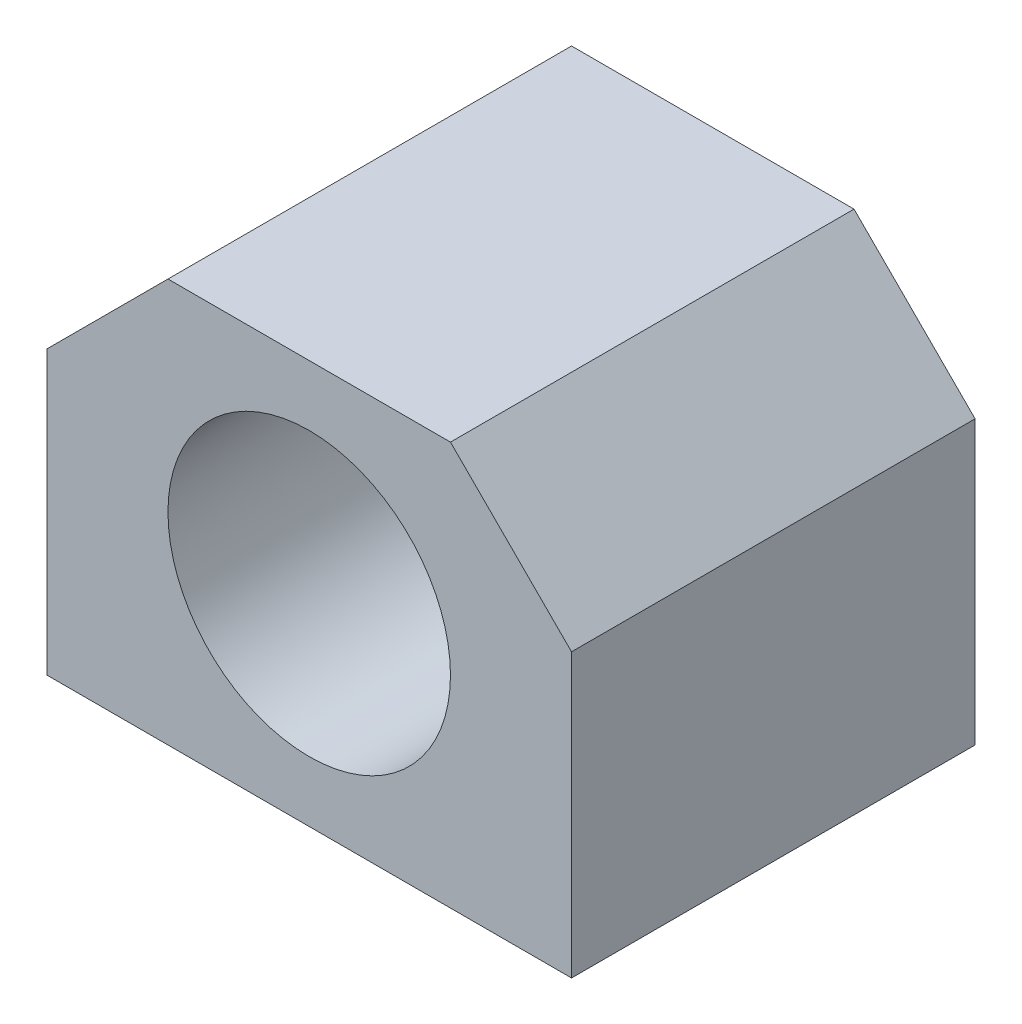
ISO-10303-21;
HEADER;
FILE_DESCRIPTION(('STEP AP214'),'2;1');
FILE_NAME('part.step','',(''),(''),'','','');
FILE_SCHEMA(('AUTOMOTIVE_DESIGN { 1 0 10303 214 1 1 1 1 }'));
ENDSEC;
DATA;
#1=APPLICATION_CONTEXT('core data for automotive mechanical design processes');
#2=APPLICATION_PROTOCOL_DEFINITION('international standard','automotive_design',2000,#1);
#3=PRODUCT_CONTEXT('',#1,'mechanical');
#4=PRODUCT('Part','Part','',(#3));
#5=PRODUCT_RELATED_PRODUCT_CATEGORY('part','',(#4));
#6=PRODUCT_DEFINITION_FORMATION('','',#4);
#7=PRODUCT_DEFINITION_CONTEXT('part definition',#1,'design');
#8=PRODUCT_DEFINITION('design','',#6,#7);
#9=PRODUCT_DEFINITION_SHAPE('','',#8);
#10=(LENGTH_UNIT() NAMED_UNIT(*) SI_UNIT(.MILLI.,.METRE.));
#11=(NAMED_UNIT(*) PLANE_ANGLE_UNIT() SI_UNIT($,.RADIAN.));
#12=(NAMED_UNIT(*) SI_UNIT($,.STERADIAN.) SOLID_ANGLE_UNIT());
#13=UNCERTAINTY_MEASURE_WITH_UNIT(LENGTH_MEASURE(1.E-05),#10,'distance_accuracy_value','');
#14=(GEOMETRIC_REPRESENTATION_CONTEXT(3) GLOBAL_UNCERTAINTY_ASSIGNED_CONTEXT((#13)) GLOBAL_UNIT_ASSIGNED_CONTEXT((#10,
#11,#12)) REPRESENTATION_CONTEXT('',''));
#15=CARTESIAN_POINT('',(0.,0.,0.));
#16=DIRECTION('',(0.,0.,1.));
#17=DIRECTION('',(1.,0.,0.));
#18=AXIS2_PLACEMENT_3D('',#15,#16,#17);
#19=CARTESIAN_POINT('',(0.,0.,40.));
#20=DIRECTION('',(0.,0.,1.));
#21=DIRECTION('',(1.,0.,0.));
#22=AXIS2_PLACEMENT_3D('',#19,#20,#21);
#23=PLANE('',#22);
#24=DIRECTION('',(1.,0.,0.));
#25=VECTOR('',#24,1.);
#26=CARTESIAN_POINT('',(-26.,-20.,40.));
#27=LINE('',#26,#25);
#28=CARTESIAN_POINT('',(-26.,-20.,40.));
#29=VERTEX_POINT('',#28);
#30=CARTESIAN_POINT('',(26.,-20.,40.));
#31=VERTEX_POINT('',#30);
#32=EDGE_CURVE('E149',#29,#31,#27,.T.);
#33=ORIENTED_EDGE('',*,*,#32,.T.);
#34=DIRECTION('',(0.,1.,0.));
#35=VECTOR('',#34,1.);
#36=CARTESIAN_POINT('',(26.,-20.,40.));
#37=LINE('',#36,#35);
#38=CARTESIAN_POINT('',(26.,7.99999999999997,40.));
#39=VERTEX_POINT('',#38);
#40=EDGE_CURVE('E97',#31,#39,#37,.T.);
#41=ORIENTED_EDGE('',*,*,#40,.T.);
#42=DIRECTION('',(-0.707106781186546,0.707106781186549,0.));
#43=VECTOR('',#42,1.);
#44=CARTESIAN_POINT('',(26.,7.99999999999997,40.));
#45=LINE('',#44,#43);
#46=CARTESIAN_POINT('',(14.,20.,40.));
#47=VERTEX_POINT('',#46);
#48=EDGE_CURVE('E110',#39,#47,#45,.T.);
#49=ORIENTED_EDGE('',*,*,#48,.T.);
#50=DIRECTION('',(-1.,0.,0.));
#51=VECTOR('',#50,1.);
#52=CARTESIAN_POINT('',(-14.,20.,40.));
#53=LINE('',#52,#51);
#54=CARTESIAN_POINT('',(-14.,20.,40.));
#55=VERTEX_POINT('',#54);
#56=EDGE_CURVE('E104',#47,#55,#53,.T.);
#57=ORIENTED_EDGE('',*,*,#56,.T.);
#58=DIRECTION('',(-0.707106781186546,-0.707106781186549,0.));
#59=VECTOR('',#58,1.);
#60=CARTESIAN_POINT('',(-26.,7.99999999999995,40.));
#61=LINE('',#60,#59);
#62=CARTESIAN_POINT('',(-26.,7.99999999999995,40.));
#63=VERTEX_POINT('',#62);
#64=EDGE_CURVE('E108',#55,#63,#61,.T.);
#65=ORIENTED_EDGE('',*,*,#64,.T.);
#66=DIRECTION('',(0.,-1.,0.));
#67=VECTOR('',#66,1.);
#68=CARTESIAN_POINT('',(-26.,-20.,40.));
#69=LINE('',#68,#67);
#70=EDGE_CURVE('E60',#63,#29,#69,.T.);
#71=ORIENTED_EDGE('',*,*,#70,.T.);
#72=EDGE_LOOP('',(#33,#41,#49,#57,#65,#71));
#73=FACE_BOUND('',#72,.T.);
#74=CARTESIAN_POINT('',(0.,0.,40.));
#75=DIRECTION('',(0.,0.,1.));
#76=DIRECTION('',(1.,0.,0.));
#77=AXIS2_PLACEMENT_3D('',#74,#75,#76);
#78=CIRCLE('',#77,14.);
#79=CARTESIAN_POINT('',(14.,0.,40.));
#80=VERTEX_POINT('',#79);
#81=EDGE_CURVE('E137',#80,#80,#78,.T.);
#82=ORIENTED_EDGE('',*,*,#81,.F.);
#83=EDGE_LOOP('',(#82));
#84=FACE_BOUND('',#83,.T.);
#85=ADVANCED_FACE('F42',(#73,#84),#23,.T.);
#86=CARTESIAN_POINT('',(0.,0.,0.));
#87=DIRECTION('',(0.,0.,1.));
#88=DIRECTION('',(1.,0.,0.));
#89=AXIS2_PLACEMENT_3D('',#86,#87,#88);
#90=PLANE('',#89);
#91=DIRECTION('',(1.,0.,0.));
#92=VECTOR('',#91,1.);
#93=CARTESIAN_POINT('',(-26.,-20.,0.));
#94=LINE('',#93,#92);
#95=CARTESIAN_POINT('',(-26.,-20.,0.));
#96=VERTEX_POINT('',#95);
#97=CARTESIAN_POINT('',(26.,-20.,0.));
#98=VERTEX_POINT('',#97);
#99=EDGE_CURVE('E132',#96,#98,#94,.T.);
#100=ORIENTED_EDGE('',*,*,#99,.F.);
#101=DIRECTION('',(0.,-1.,0.));
#102=VECTOR('',#101,1.);
#103=CARTESIAN_POINT('',(-26.,-20.,0.));
#104=LINE('',#103,#102);
#105=CARTESIAN_POINT('',(-26.,7.99999999999995,0.));
#106=VERTEX_POINT('',#105);
#107=EDGE_CURVE('E89',#106,#96,#104,.T.);
#108=ORIENTED_EDGE('',*,*,#107,.F.);
#109=DIRECTION('',(-0.707106781186546,-0.707106781186549,0.));
#110=VECTOR('',#109,1.);
#111=CARTESIAN_POINT('',(-26.,7.99999999999995,0.));
#112=LINE('',#111,#110);
#113=CARTESIAN_POINT('',(-14.,20.,0.));
#114=VERTEX_POINT('',#113);
#115=EDGE_CURVE('E83',#114,#106,#112,.T.);
#116=ORIENTED_EDGE('',*,*,#115,.F.);
#117=DIRECTION('',(-1.,0.,0.));
#118=VECTOR('',#117,1.);
#119=CARTESIAN_POINT('',(-14.,20.,0.));
#120=LINE('',#119,#118);
#121=CARTESIAN_POINT('',(14.,20.,0.));
#122=VERTEX_POINT('',#121);
#123=EDGE_CURVE('E119',#122,#114,#120,.T.);
#124=ORIENTED_EDGE('',*,*,#123,.F.);
#125=DIRECTION('',(-0.707106781186546,0.707106781186549,0.));
#126=VECTOR('',#125,1.);
#127=CARTESIAN_POINT('',(26.,7.99999999999997,0.));
#128=LINE('',#127,#126);
#129=CARTESIAN_POINT('',(26.,7.99999999999997,0.));
#130=VERTEX_POINT('',#129);
#131=EDGE_CURVE('E140',#130,#122,#128,.T.);
#132=ORIENTED_EDGE('',*,*,#131,.F.);
#133=DIRECTION('',(0.,1.,0.));
#134=VECTOR('',#133,1.);
#135=CARTESIAN_POINT('',(26.,-20.,0.));
#136=LINE('',#135,#134);
#137=EDGE_CURVE('E136',#98,#130,#136,.T.);
#138=ORIENTED_EDGE('',*,*,#137,.F.);
#139=EDGE_LOOP('',(#100,#108,#116,#124,#132,#138));
#140=FACE_BOUND('',#139,.T.);
#141=CARTESIAN_POINT('',(0.,0.,0.));
#142=DIRECTION('',(0.,0.,1.));
#143=DIRECTION('',(1.,0.,0.));
#144=AXIS2_PLACEMENT_3D('',#141,#142,#143);
#145=CIRCLE('',#144,14.);
#146=CARTESIAN_POINT('',(14.,0.,0.));
#147=VERTEX_POINT('',#146);
#148=EDGE_CURVE('E251',#147,#147,#145,.T.);
#149=ORIENTED_EDGE('',*,*,#148,.T.);
#150=EDGE_LOOP('',(#149));
#151=FACE_BOUND('',#150,.T.);
#152=ADVANCED_FACE('F162',(#140,#151),#90,.F.);
#153=CARTESIAN_POINT('',(-26.,-20.,40.));
#154=DIRECTION('',(0.,1.,0.));
#155=DIRECTION('',(-1.,0.,0.));
#156=AXIS2_PLACEMENT_3D('',#153,#154,#155);
#157=PLANE('',#156);
#158=CARTESIAN_POINT('',(-20.,-20.,8.));
#159=DIRECTION('',(0.,-1.,0.));
#160=DIRECTION('',(1.,0.,0.));
#161=AXIS2_PLACEMENT_3D('',#158,#159,#160);
#162=CIRCLE('',#161,2.1);
#163=CARTESIAN_POINT('',(-17.9,-20.,8.));
#164=VERTEX_POINT('',#163);
#165=EDGE_CURVE('E245',#164,#164,#162,.T.);
#166=ORIENTED_EDGE('',*,*,#165,.F.);
#167=EDGE_LOOP('',(#166));
#168=FACE_BOUND('',#167,.T.);
#169=CARTESIAN_POINT('',(20.,-20.,8.));
#170=DIRECTION('',(0.,-1.,0.));
#171=DIRECTION('',(1.,0.,0.));
#172=AXIS2_PLACEMENT_3D('',#169,#170,#171);
#173=CIRCLE('',#172,2.1);
#174=CARTESIAN_POINT('',(22.1,-20.,8.));
#175=VERTEX_POINT('',#174);
#176=EDGE_CURVE('E237',#175,#175,#173,.T.);
#177=ORIENTED_EDGE('',*,*,#176,.F.);
#178=EDGE_LOOP('',(#177));
#179=FACE_BOUND('',#178,.T.);
#180=CARTESIAN_POINT('',(20.,-20.,32.));
#181=DIRECTION('',(0.,-1.,0.));
#182=DIRECTION('',(1.,0.,0.));
#183=AXIS2_PLACEMENT_3D('',#180,#181,#182);
#184=CIRCLE('',#183,2.1);
#185=CARTESIAN_POINT('',(22.1,-20.,32.));
#186=VERTEX_POINT('',#185);
#187=EDGE_CURVE('E223',#186,#186,#184,.T.);
#188=ORIENTED_EDGE('',*,*,#187,.F.);
#189=EDGE_LOOP('',(#188));
#190=FACE_BOUND('',#189,.T.);
#191=CARTESIAN_POINT('',(-20.,-20.,32.));
#192=DIRECTION('',(0.,-1.,0.));
#193=DIRECTION('',(1.,0.,0.));
#194=AXIS2_PLACEMENT_3D('',#191,#192,#193);
#195=CIRCLE('',#194,2.1);
#196=CARTESIAN_POINT('',(-17.9,-20.,32.));
#197=VERTEX_POINT('',#196);
#198=EDGE_CURVE('E222',#197,#197,#195,.T.);
#199=ORIENTED_EDGE('',*,*,#198,.F.);
#200=EDGE_LOOP('',(#199));
#201=FACE_BOUND('',#200,.T.);
#202=ORIENTED_EDGE('',*,*,#99,.T.);
#203=DIRECTION('',(0.,0.,-1.));
#204=VECTOR('',#203,1.);
#205=CARTESIAN_POINT('',(26.,-20.,40.));
#206=LINE('',#205,#204);
#207=EDGE_CURVE('E11',#31,#98,#206,.T.);
#208=ORIENTED_EDGE('',*,*,#207,.F.);
#209=ORIENTED_EDGE('',*,*,#32,.F.);
#210=DIRECTION('',(0.,0.,-1.));
#211=VECTOR('',#210,1.);
#212=CARTESIAN_POINT('',(-26.,-20.,40.));
#213=LINE('',#212,#211);
#214=EDGE_CURVE('E128',#29,#96,#213,.T.);
#215=ORIENTED_EDGE('',*,*,#214,.T.);
#216=EDGE_LOOP('',(#202,#208,#209,#215));
#217=FACE_BOUND('',#216,.T.);
#218=ADVANCED_FACE('F44',(#168,#179,#190,#201,#217),#157,.F.);
#219=CARTESIAN_POINT('',(26.,-20.,40.));
#220=DIRECTION('',(-1.,0.,0.));
#221=DIRECTION('',(0.,-1.,0.));
#222=AXIS2_PLACEMENT_3D('',#219,#220,#221);
#223=PLANE('',#222);
#224=ORIENTED_EDGE('',*,*,#137,.T.);
#225=DIRECTION('',(0.,0.,-1.));
#226=VECTOR('',#225,1.);
#227=CARTESIAN_POINT('',(26.,7.99999999999997,40.));
#228=LINE('',#227,#226);
#229=EDGE_CURVE('E52',#39,#130,#228,.T.);
#230=ORIENTED_EDGE('',*,*,#229,.F.);
#231=ORIENTED_EDGE('',*,*,#40,.F.);
#232=ORIENTED_EDGE('',*,*,#207,.T.);
#233=EDGE_LOOP('',(#224,#230,#231,#232));
#234=FACE_BOUND('',#233,.T.);
#235=ADVANCED_FACE('F271',(#234),#223,.F.);
#236=CARTESIAN_POINT('',(26.,7.99999999999997,40.));
#237=DIRECTION('',(-0.707106781186549,-0.707106781186546,0.));
#238=DIRECTION('',(0.707106781186546,-0.707106781186549,0.));
#239=AXIS2_PLACEMENT_3D('',#236,#237,#238);
#240=PLANE('',#239);
#241=ORIENTED_EDGE('',*,*,#131,.T.);
#242=DIRECTION('',(0.,0.,-1.));
#243=VECTOR('',#242,1.);
#244=CARTESIAN_POINT('',(14.,20.,40.));
#245=LINE('',#244,#243);
#246=EDGE_CURVE('E121',#47,#122,#245,.T.);
#247=ORIENTED_EDGE('',*,*,#246,.F.);
#248=ORIENTED_EDGE('',*,*,#48,.F.);
#249=ORIENTED_EDGE('',*,*,#229,.T.);
#250=EDGE_LOOP('',(#241,#247,#248,#249));
#251=FACE_BOUND('',#250,.T.);
#252=ADVANCED_FACE('F159',(#251),#240,.F.);
#253=CARTESIAN_POINT('',(-14.,20.,40.));
#254=DIRECTION('',(0.,-1.,0.));
#255=DIRECTION('',(1.,0.,0.));
#256=AXIS2_PLACEMENT_3D('',#253,#254,#255);
#257=PLANE('',#256);
#258=ORIENTED_EDGE('',*,*,#123,.T.);
#259=DIRECTION('',(0.,0.,-1.));
#260=VECTOR('',#259,1.);
#261=CARTESIAN_POINT('',(-14.,20.,40.));
#262=LINE('',#261,#260);
#263=EDGE_CURVE('E116',#55,#114,#262,.T.);
#264=ORIENTED_EDGE('',*,*,#263,.F.);
#265=ORIENTED_EDGE('',*,*,#56,.F.);
#266=ORIENTED_EDGE('',*,*,#246,.T.);
#267=EDGE_LOOP('',(#258,#264,#265,#266));
#268=FACE_BOUND('',#267,.T.);
#269=ADVANCED_FACE('F117',(#268),#257,.F.);
#270=CARTESIAN_POINT('',(-26.,7.99999999999995,40.));
#271=DIRECTION('',(0.707106781186549,-0.707106781186546,0.));
#272=DIRECTION('',(0.707106781186546,0.707106781186549,0.));
#273=AXIS2_PLACEMENT_3D('',#270,#271,#272);
#274=PLANE('',#273);
#275=ORIENTED_EDGE('',*,*,#115,.T.);
#276=DIRECTION('',(0.,0.,-1.));
#277=VECTOR('',#276,1.);
#278=CARTESIAN_POINT('',(-26.,7.99999999999995,40.));
#279=LINE('',#278,#277);
#280=EDGE_CURVE('E122',#63,#106,#279,.T.);
#281=ORIENTED_EDGE('',*,*,#280,.F.);
#282=ORIENTED_EDGE('',*,*,#64,.F.);
#283=ORIENTED_EDGE('',*,*,#263,.T.);
#284=EDGE_LOOP('',(#275,#281,#282,#283));
#285=FACE_BOUND('',#284,.T.);
#286=ADVANCED_FACE('F124',(#285),#274,.F.);
#287=CARTESIAN_POINT('',(-26.,-20.,40.));
#288=DIRECTION('',(1.,0.,0.));
#289=DIRECTION('',(0.,0.,-1.));
#290=AXIS2_PLACEMENT_3D('',#287,#288,#289);
#291=PLANE('',#290);
#292=ORIENTED_EDGE('',*,*,#107,.T.);
#293=ORIENTED_EDGE('',*,*,#214,.F.);
#294=ORIENTED_EDGE('',*,*,#70,.F.);
#295=ORIENTED_EDGE('',*,*,#280,.T.);
#296=EDGE_LOOP('',(#292,#293,#294,#295));
#297=FACE_BOUND('',#296,.T.);
#298=ADVANCED_FACE('F167',(#297),#291,.F.);
#299=CARTESIAN_POINT('',(0.,0.,40.));
#300=DIRECTION('',(0.,0.,-1.));
#301=DIRECTION('',(-1.,0.,0.));
#302=AXIS2_PLACEMENT_3D('',#299,#300,#301);
#303=CYLINDRICAL_SURFACE('',#302,14.);
#304=ORIENTED_EDGE('',*,*,#81,.T.);
#305=EDGE_LOOP('',(#304));
#306=FACE_BOUND('',#305,.T.);
#307=ORIENTED_EDGE('',*,*,#148,.F.);
#308=EDGE_LOOP('',(#307));
#309=FACE_BOUND('',#308,.T.);
#310=ADVANCED_FACE('F169',(#306,#309),#303,.F.);
#311=CARTESIAN_POINT('',(-20.,-10.,32.));
#312=DIRECTION('',(0.,-1.,0.));
#313=DIRECTION('',(1.,0.,0.));
#314=AXIS2_PLACEMENT_3D('',#311,#312,#313);
#315=CYLINDRICAL_SURFACE('',#314,2.1);
#316=CARTESIAN_POINT('',(-20.,-10.,32.));
#317=DIRECTION('',(0.,-1.,0.));
#318=DIRECTION('',(1.,0.,0.));
#319=AXIS2_PLACEMENT_3D('',#316,#317,#318);
#320=CIRCLE('',#319,2.1);
#321=CARTESIAN_POINT('',(-17.9,-10.,32.));
#322=VERTEX_POINT('',#321);
#323=EDGE_CURVE('E228',#322,#322,#320,.T.);
#324=ORIENTED_EDGE('',*,*,#323,.F.);
#325=EDGE_LOOP('',(#324));
#326=FACE_BOUND('',#325,.T.);
#327=ORIENTED_EDGE('',*,*,#198,.T.);
#328=EDGE_LOOP('',(#327));
#329=FACE_BOUND('',#328,.T.);
#330=ADVANCED_FACE('F175',(#326,#329),#315,.F.);
#331=CARTESIAN_POINT('',(-20.,-10.,32.));
#332=DIRECTION('',(0.,-1.,0.));
#333=DIRECTION('',(1.,0.,0.));
#334=AXIS2_PLACEMENT_3D('',#331,#332,#333);
#335=PLANE('',#334);
#336=ORIENTED_EDGE('',*,*,#323,.T.);
#337=EDGE_LOOP('',(#336));
#338=FACE_BOUND('',#337,.T.);
#339=ADVANCED_FACE('F188',(#338),#335,.T.);
#340=CARTESIAN_POINT('',(20.,-9.99999999999999,32.));
#341=DIRECTION('',(0.,-1.,0.));
#342=DIRECTION('',(1.,0.,0.));
#343=AXIS2_PLACEMENT_3D('',#340,#341,#342);
#344=CYLINDRICAL_SURFACE('',#343,2.1);
#345=CARTESIAN_POINT('',(20.,-9.99999999999999,32.));
#346=DIRECTION('',(0.,-1.,0.));
#347=DIRECTION('',(1.,0.,0.));
#348=AXIS2_PLACEMENT_3D('',#345,#346,#347);
#349=CIRCLE('',#348,2.1);
#350=CARTESIAN_POINT('',(22.1,-9.99999999999999,32.));
#351=VERTEX_POINT('',#350);
#352=EDGE_CURVE('E220',#351,#351,#349,.T.);
#353=ORIENTED_EDGE('',*,*,#352,.F.);
#354=EDGE_LOOP('',(#353));
#355=FACE_BOUND('',#354,.T.);
#356=ORIENTED_EDGE('',*,*,#187,.T.);
#357=EDGE_LOOP('',(#356));
#358=FACE_BOUND('',#357,.T.);
#359=ADVANCED_FACE('F192',(#355,#358),#344,.F.);
#360=CARTESIAN_POINT('',(20.,-9.99999999999999,32.));
#361=DIRECTION('',(0.,-1.,0.));
#362=DIRECTION('',(1.,0.,0.));
#363=AXIS2_PLACEMENT_3D('',#360,#361,#362);
#364=PLANE('',#363);
#365=ORIENTED_EDGE('',*,*,#352,.T.);
#366=EDGE_LOOP('',(#365));
#367=FACE_BOUND('',#366,.T.);
#368=ADVANCED_FACE('F206',(#367),#364,.T.);
#369=CARTESIAN_POINT('',(20.,-9.99999999999999,8.));
#370=DIRECTION('',(0.,-1.,0.));
#371=DIRECTION('',(1.,0.,0.));
#372=AXIS2_PLACEMENT_3D('',#369,#370,#371);
#373=CYLINDRICAL_SURFACE('',#372,2.1);
#374=CARTESIAN_POINT('',(20.,-9.99999999999999,8.));
#375=DIRECTION('',(0.,-1.,0.));
#376=DIRECTION('',(1.,0.,0.));
#377=AXIS2_PLACEMENT_3D('',#374,#375,#376);
#378=CIRCLE('',#377,2.1);
#379=CARTESIAN_POINT('',(22.1,-9.99999999999999,8.));
#380=VERTEX_POINT('',#379);
#381=EDGE_CURVE('E231',#380,#380,#378,.T.);
#382=ORIENTED_EDGE('',*,*,#381,.F.);
#383=EDGE_LOOP('',(#382));
#384=FACE_BOUND('',#383,.T.);
#385=ORIENTED_EDGE('',*,*,#176,.T.);
#386=EDGE_LOOP('',(#385));
#387=FACE_BOUND('',#386,.T.);
#388=ADVANCED_FACE('F203',(#384,#387),#373,.F.);
#389=CARTESIAN_POINT('',(20.,-9.99999999999999,8.));
#390=DIRECTION('',(0.,-1.,0.));
#391=DIRECTION('',(1.,0.,0.));
#392=AXIS2_PLACEMENT_3D('',#389,#390,#391);
#393=PLANE('',#392);
#394=ORIENTED_EDGE('',*,*,#381,.T.);
#395=EDGE_LOOP('',(#394));
#396=FACE_BOUND('',#395,.T.);
#397=ADVANCED_FACE('F198',(#396),#393,.T.);
#398=CARTESIAN_POINT('',(-20.,-10.,8.));
#399=DIRECTION('',(0.,-1.,0.));
#400=DIRECTION('',(1.,0.,0.));
#401=AXIS2_PLACEMENT_3D('',#398,#399,#400);
#402=CYLINDRICAL_SURFACE('',#401,2.1);
#403=CARTESIAN_POINT('',(-20.,-10.,8.));
#404=DIRECTION('',(0.,-1.,0.));
#405=DIRECTION('',(1.,0.,0.));
#406=AXIS2_PLACEMENT_3D('',#403,#404,#405);
#407=CIRCLE('',#406,2.1);
#408=CARTESIAN_POINT('',(-17.9,-10.,8.));
#409=VERTEX_POINT('',#408);
#410=EDGE_CURVE('E241',#409,#409,#407,.T.);
#411=ORIENTED_EDGE('',*,*,#410,.F.);
#412=EDGE_LOOP('',(#411));
#413=FACE_BOUND('',#412,.T.);
#414=ORIENTED_EDGE('',*,*,#165,.T.);
#415=EDGE_LOOP('',(#414));
#416=FACE_BOUND('',#415,.T.);
#417=ADVANCED_FACE('F194',(#413,#416),#402,.F.);
#418=CARTESIAN_POINT('',(-20.,-10.,8.));
#419=DIRECTION('',(0.,-1.,0.));
#420=DIRECTION('',(1.,0.,0.));
#421=AXIS2_PLACEMENT_3D('',#418,#419,#420);
#422=PLANE('',#421);
#423=ORIENTED_EDGE('',*,*,#410,.T.);
#424=EDGE_LOOP('',(#423));
#425=FACE_BOUND('',#424,.T.);
#426=ADVANCED_FACE('F197',(#425),#422,.T.);
#427=CLOSED_SHELL('',(#85,#152,#218,#235,#252,#269,#286,#298,#310,#330,#339,#359,#368,#388,#397,
#417,#426));
#428=MANIFOLD_SOLID_BREP('B2',#427);
#429=ADVANCED_BREP_SHAPE_REPRESENTATION('',(#18,#428),#14);
#430=SHAPE_DEFINITION_REPRESENTATION(#9,#429);
ENDSEC;
END-ISO-10303-21;
